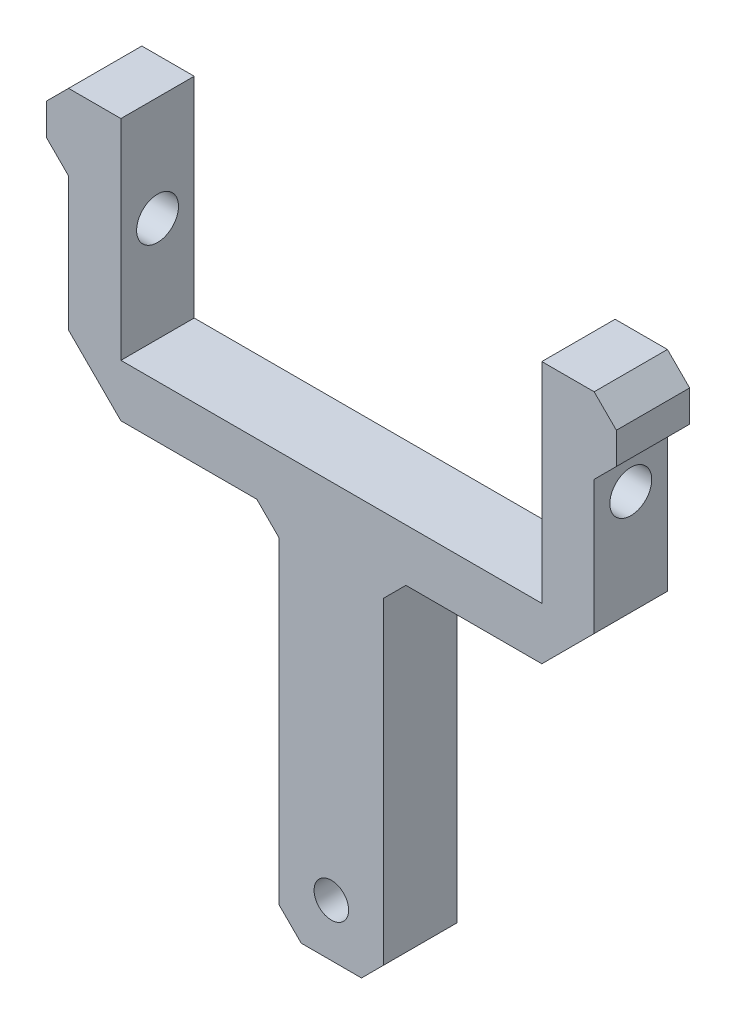
ISO-10303-21;
HEADER;
FILE_DESCRIPTION(('STEP AP214'),'2;1');
FILE_NAME('part.step','',(''),(''),'','','');
FILE_SCHEMA(('AUTOMOTIVE_DESIGN { 1 0 10303 214 1 1 1 1 }'));
ENDSEC;
DATA;
#1=APPLICATION_CONTEXT('core data for automotive mechanical design processes');
#2=APPLICATION_PROTOCOL_DEFINITION('international standard','automotive_design',2000,#1);
#3=PRODUCT_CONTEXT('',#1,'mechanical');
#4=PRODUCT('Part','Part','',(#3));
#5=PRODUCT_RELATED_PRODUCT_CATEGORY('part','',(#4));
#6=PRODUCT_DEFINITION_FORMATION('','',#4);
#7=PRODUCT_DEFINITION_CONTEXT('part definition',#1,'design');
#8=PRODUCT_DEFINITION('design','',#6,#7);
#9=PRODUCT_DEFINITION_SHAPE('','',#8);
#10=(LENGTH_UNIT() NAMED_UNIT(*) SI_UNIT(.MILLI.,.METRE.));
#11=(NAMED_UNIT(*) PLANE_ANGLE_UNIT() SI_UNIT($,.RADIAN.));
#12=(NAMED_UNIT(*) SI_UNIT($,.STERADIAN.) SOLID_ANGLE_UNIT());
#13=UNCERTAINTY_MEASURE_WITH_UNIT(LENGTH_MEASURE(1.E-05),#10,'distance_accuracy_value','');
#14=(GEOMETRIC_REPRESENTATION_CONTEXT(3) GLOBAL_UNCERTAINTY_ASSIGNED_CONTEXT((#13)) GLOBAL_UNIT_ASSIGNED_CONTEXT((#10,
#11,#12)) REPRESENTATION_CONTEXT('',''));
#15=CARTESIAN_POINT('',(0.,0.,0.));
#16=DIRECTION('',(0.,0.,1.));
#17=DIRECTION('',(1.,0.,0.));
#18=AXIS2_PLACEMENT_3D('',#15,#16,#17);
#19=CARTESIAN_POINT('',(-11.1286796564404,11.1286796564404,7.));
#20=DIRECTION('',(0.707106781186546,-0.707106781186549,0.));
#21=DIRECTION('',(0.707106781186549,0.707106781186546,0.));
#22=AXIS2_PLACEMENT_3D('',#19,#20,#21);
#23=PLANE('',#22);
#24=DIRECTION('',(0.,0.,-1.));
#25=VECTOR('',#24,1.);
#26=CARTESIAN_POINT('',(25.1,47.3573593128807,7.));
#27=LINE('',#26,#25);
#28=CARTESIAN_POINT('',(25.1,47.3573593128807,7.));
#29=VERTEX_POINT('',#28);
#30=CARTESIAN_POINT('',(25.1,47.3573593128807,6.03868075976481));
#31=VERTEX_POINT('',#30);
#32=EDGE_CURVE('E224',#29,#31,#27,.T.);
#33=ORIENTED_EDGE('',*,*,#32,.T.);
#34=CARTESIAN_POINT('',(22.34,44.5973593128807,3.5));
#35=DIRECTION('',(0.707106781186546,-0.707106781186549,0.));
#36=DIRECTION('',(-0.707106781186549,-0.707106781186546,0.));
#37=AXIS2_PLACEMENT_3D('',#34,#35,#36);
#38=ELLIPSE('',#37,5.30330085889912,3.75);
#39=CARTESIAN_POINT('',(25.1,47.3573593128807,0.961319240235193));
#40=VERTEX_POINT('',#39);
#41=EDGE_CURVE('E215',#31,#40,#38,.F.);
#42=ORIENTED_EDGE('',*,*,#41,.T.);
#43=CARTESIAN_POINT('',(25.1,47.3573593128807,0.));
#44=VERTEX_POINT('',#43);
#45=EDGE_CURVE('E221',#40,#44,#27,.T.);
#46=ORIENTED_EDGE('',*,*,#45,.T.);
#47=DIRECTION('',(-0.707106781186549,-0.707106781186546,0.));
#48=VECTOR('',#47,1.);
#49=CARTESIAN_POINT('',(-11.1286796564404,11.1286796564404,0.));
#50=LINE('',#49,#48);
#51=CARTESIAN_POINT('',(27.2213203435596,49.4786796564403,0.));
#52=VERTEX_POINT('',#51);
#53=EDGE_CURVE('E279',#52,#44,#50,.T.);
#54=ORIENTED_EDGE('',*,*,#53,.F.);
#55=DIRECTION('',(0.,0.,-1.));
#56=VECTOR('',#55,1.);
#57=CARTESIAN_POINT('',(27.2213203435596,49.4786796564403,7.));
#58=LINE('',#57,#56);
#59=CARTESIAN_POINT('',(27.2213203435596,49.4786796564403,7.));
#60=VERTEX_POINT('',#59);
#61=EDGE_CURVE('E233',#60,#52,#58,.T.);
#62=ORIENTED_EDGE('',*,*,#61,.F.);
#63=DIRECTION('',(-0.707106781186549,-0.707106781186546,0.));
#64=VECTOR('',#63,1.);
#65=CARTESIAN_POINT('',(-11.1286796564404,11.1286796564404,7.));
#66=LINE('',#65,#64);
#67=EDGE_CURVE('E416',#60,#29,#66,.T.);
#68=ORIENTED_EDGE('',*,*,#67,.T.);
#69=EDGE_LOOP('',(#33,#42,#46,#54,#62,#68));
#70=FACE_BOUND('',#69,.T.);
#71=ADVANCED_FACE('F41',(#70),#23,.T.);
#72=CARTESIAN_POINT('',(11.1286796564404,11.1286796564404,7.));
#73=DIRECTION('',(0.707106781186546,0.707106781186549,0.));
#74=DIRECTION('',(-0.707106781186549,0.707106781186546,0.));
#75=AXIS2_PLACEMENT_3D('',#72,#73,#74);
#76=PLANE('',#75);
#77=CARTESIAN_POINT('',(-22.34,44.5973593128807,3.5));
#78=DIRECTION('',(0.707106781186546,0.707106781186549,0.));
#79=DIRECTION('',(0.707106781186549,-0.707106781186546,0.));
#80=AXIS2_PLACEMENT_3D('',#77,#78,#79);
#81=ELLIPSE('',#80,5.30330085889912,3.75);
#82=CARTESIAN_POINT('',(-25.1,47.3573593128807,6.0386807597648));
#83=VERTEX_POINT('',#82);
#84=CARTESIAN_POINT('',(-25.1,47.3573593128807,0.9613192402352));
#85=VERTEX_POINT('',#84);
#86=EDGE_CURVE('E872',#83,#85,#81,.F.);
#87=ORIENTED_EDGE('',*,*,#86,.F.);
#88=DIRECTION('',(0.,0.,-1.));
#89=VECTOR('',#88,1.);
#90=CARTESIAN_POINT('',(-25.1,47.3573593128807,7.));
#91=LINE('',#90,#89);
#92=CARTESIAN_POINT('',(-25.1,47.3573593128807,7.));
#93=VERTEX_POINT('',#92);
#94=EDGE_CURVE('E355',#93,#83,#91,.T.);
#95=ORIENTED_EDGE('',*,*,#94,.F.);
#96=DIRECTION('',(0.707106781186549,-0.707106781186546,0.));
#97=VECTOR('',#96,1.);
#98=CARTESIAN_POINT('',(11.1286796564404,11.1286796564404,7.));
#99=LINE('',#98,#97);
#100=CARTESIAN_POINT('',(-27.2213203435596,49.4786796564403,7.));
#101=VERTEX_POINT('',#100);
#102=EDGE_CURVE('E439',#101,#93,#99,.T.);
#103=ORIENTED_EDGE('',*,*,#102,.F.);
#104=DIRECTION('',(0.,0.,-1.));
#105=VECTOR('',#104,1.);
#106=CARTESIAN_POINT('',(-27.2213203435596,49.4786796564403,7.));
#107=LINE('',#106,#105);
#108=CARTESIAN_POINT('',(-27.2213203435596,49.4786796564403,0.));
#109=VERTEX_POINT('',#108);
#110=EDGE_CURVE('E358',#101,#109,#107,.T.);
#111=ORIENTED_EDGE('',*,*,#110,.T.);
#112=DIRECTION('',(0.707106781186549,-0.707106781186546,0.));
#113=VECTOR('',#112,1.);
#114=CARTESIAN_POINT('',(11.1286796564404,11.1286796564404,0.));
#115=LINE('',#114,#113);
#116=CARTESIAN_POINT('',(-25.1,47.3573593128807,0.));
#117=VERTEX_POINT('',#116);
#118=EDGE_CURVE('E315',#109,#117,#115,.T.);
#119=ORIENTED_EDGE('',*,*,#118,.T.);
#120=EDGE_CURVE('E354',#85,#117,#91,.T.);
#121=ORIENTED_EDGE('',*,*,#120,.F.);
#122=EDGE_LOOP('',(#87,#95,#103,#111,#119,#121));
#123=FACE_BOUND('',#122,.T.);
#124=ADVANCED_FACE('F506',(#123),#76,.F.);
#125=CARTESIAN_POINT('',(-5.,0.,7.));
#126=DIRECTION('',(-1.,0.,0.));
#127=DIRECTION('',(0.,0.,1.));
#128=AXIS2_PLACEMENT_3D('',#125,#126,#127);
#129=PLANE('',#128);
#130=DIRECTION('',(0.,0.,-1.));
#131=VECTOR('',#130,1.);
#132=CARTESIAN_POINT('',(-5.,-2.87867965644036,7.));
#133=LINE('',#132,#131);
#134=CARTESIAN_POINT('',(-5.,-2.87867965644036,7.));
#135=VERTEX_POINT('',#134);
#136=CARTESIAN_POINT('',(-5.,-2.87867965644036,0.));
#137=VERTEX_POINT('',#136);
#138=EDGE_CURVE('E817',#135,#137,#133,.T.);
#139=ORIENTED_EDGE('',*,*,#138,.F.);
#140=DIRECTION('',(0.,1.,0.));
#141=VECTOR('',#140,1.);
#142=CARTESIAN_POINT('',(-5.,0.,7.));
#143=LINE('',#142,#141);
#144=CARTESIAN_POINT('',(-5.,27.4786796564403,7.));
#145=VERTEX_POINT('',#144);
#146=EDGE_CURVE('E338',#135,#145,#143,.T.);
#147=ORIENTED_EDGE('',*,*,#146,.T.);
#148=DIRECTION('',(0.,0.,-1.));
#149=VECTOR('',#148,1.);
#150=CARTESIAN_POINT('',(-5.,27.4786796564403,7.));
#151=LINE('',#150,#149);
#152=CARTESIAN_POINT('',(-5.,27.4786796564403,0.));
#153=VERTEX_POINT('',#152);
#154=EDGE_CURVE('E339',#145,#153,#151,.T.);
#155=ORIENTED_EDGE('',*,*,#154,.T.);
#156=DIRECTION('',(0.,1.,0.));
#157=VECTOR('',#156,1.);
#158=CARTESIAN_POINT('',(-5.,0.,0.));
#159=LINE('',#158,#157);
#160=EDGE_CURVE('E459',#137,#153,#159,.T.);
#161=ORIENTED_EDGE('',*,*,#160,.F.);
#162=EDGE_LOOP('',(#139,#147,#155,#161));
#163=FACE_BOUND('',#162,.T.);
#164=ADVANCED_FACE('F43',(#163),#129,.T.);
#165=CARTESIAN_POINT('',(0.,-5.,7.));
#166=DIRECTION('',(0.,1.,0.));
#167=DIRECTION('',(0.,0.,1.));
#168=AXIS2_PLACEMENT_3D('',#165,#166,#167);
#169=PLANE('',#168);
#170=DIRECTION('',(1.,0.,0.));
#171=VECTOR('',#170,1.);
#172=CARTESIAN_POINT('',(0.,-5.,0.));
#173=LINE('',#172,#171);
#174=CARTESIAN_POINT('',(-2.87867965644035,-4.99999999999999,0.));
#175=VERTEX_POINT('',#174);
#176=CARTESIAN_POINT('',(2.87867965644035,-5.,0.));
#177=VERTEX_POINT('',#176);
#178=EDGE_CURVE('E462',#175,#177,#173,.T.);
#179=ORIENTED_EDGE('',*,*,#178,.T.);
#180=DIRECTION('',(0.,0.,-1.));
#181=VECTOR('',#180,1.);
#182=CARTESIAN_POINT('',(2.87867965644035,-5.,7.));
#183=LINE('',#182,#181);
#184=CARTESIAN_POINT('',(2.87867965644035,-5.,7.));
#185=VERTEX_POINT('',#184);
#186=EDGE_CURVE('E804',#185,#177,#183,.T.);
#187=ORIENTED_EDGE('',*,*,#186,.F.);
#188=DIRECTION('',(1.,0.,0.));
#189=VECTOR('',#188,1.);
#190=CARTESIAN_POINT('',(0.,-5.,7.));
#191=LINE('',#190,#189);
#192=CARTESIAN_POINT('',(-2.87867965644035,-4.99999999999999,7.));
#193=VERTEX_POINT('',#192);
#194=EDGE_CURVE('E482',#193,#185,#191,.T.);
#195=ORIENTED_EDGE('',*,*,#194,.F.);
#196=DIRECTION('',(0.,0.,-1.));
#197=VECTOR('',#196,1.);
#198=CARTESIAN_POINT('',(-2.87867965644035,-4.99999999999999,7.));
#199=LINE('',#198,#197);
#200=EDGE_CURVE('E806',#193,#175,#199,.T.);
#201=ORIENTED_EDGE('',*,*,#200,.T.);
#202=EDGE_LOOP('',(#179,#187,#195,#201));
#203=FACE_BOUND('',#202,.T.);
#204=ADVANCED_FACE('F736',(#203),#169,.F.);
#205=CARTESIAN_POINT('',(5.,0.,7.));
#206=DIRECTION('',(-1.,0.,0.));
#207=DIRECTION('',(0.,0.,1.));
#208=AXIS2_PLACEMENT_3D('',#205,#206,#207);
#209=PLANE('',#208);
#210=DIRECTION('',(0.,1.,0.));
#211=VECTOR('',#210,1.);
#212=CARTESIAN_POINT('',(5.,0.,7.));
#213=LINE('',#212,#211);
#214=CARTESIAN_POINT('',(5.,-2.87867965644037,7.));
#215=VERTEX_POINT('',#214);
#216=CARTESIAN_POINT('',(5.,27.4786796564403,7.));
#217=VERTEX_POINT('',#216);
#218=EDGE_CURVE('E476',#215,#217,#213,.T.);
#219=ORIENTED_EDGE('',*,*,#218,.F.);
#220=DIRECTION('',(0.,0.,-1.));
#221=VECTOR('',#220,1.);
#222=CARTESIAN_POINT('',(5.,-2.87867965644037,7.));
#223=LINE('',#222,#221);
#224=CARTESIAN_POINT('',(5.,-2.87867965644037,0.));
#225=VERTEX_POINT('',#224);
#226=EDGE_CURVE('E463',#215,#225,#223,.T.);
#227=ORIENTED_EDGE('',*,*,#226,.T.);
#228=DIRECTION('',(0.,1.,0.));
#229=VECTOR('',#228,1.);
#230=CARTESIAN_POINT('',(5.,0.,0.));
#231=LINE('',#230,#229);
#232=CARTESIAN_POINT('',(5.,27.4786796564403,0.));
#233=VERTEX_POINT('',#232);
#234=EDGE_CURVE('E273',#225,#233,#231,.T.);
#235=ORIENTED_EDGE('',*,*,#234,.T.);
#236=DIRECTION('',(0.,0.,-1.));
#237=VECTOR('',#236,1.);
#238=CARTESIAN_POINT('',(5.,27.4786796564403,7.));
#239=LINE('',#238,#237);
#240=EDGE_CURVE('E11',#217,#233,#239,.T.);
#241=ORIENTED_EDGE('',*,*,#240,.F.);
#242=EDGE_LOOP('',(#219,#227,#235,#241));
#243=FACE_BOUND('',#242,.T.);
#244=ADVANCED_FACE('F471',(#243),#209,.F.);
#245=CARTESIAN_POINT('',(-11.2393398282202,11.2393398282202,7.));
#246=DIRECTION('',(-0.707106781186547,0.707106781186549,0.));
#247=DIRECTION('',(-0.707106781186549,-0.707106781186546,0.));
#248=AXIS2_PLACEMENT_3D('',#245,#246,#247);
#249=PLANE('',#248);
#250=DIRECTION('',(0.707106781186549,0.707106781186546,0.));
#251=VECTOR('',#250,1.);
#252=CARTESIAN_POINT('',(-11.2393398282202,11.2393398282202,0.));
#253=LINE('',#252,#251);
#254=CARTESIAN_POINT('',(7.12132034355965,29.6,0.));
#255=VERTEX_POINT('',#254);
#256=EDGE_CURVE('E265',#233,#255,#253,.T.);
#257=ORIENTED_EDGE('',*,*,#256,.T.);
#258=DIRECTION('',(0.,0.,-1.));
#259=VECTOR('',#258,1.);
#260=CARTESIAN_POINT('',(7.12132034355965,29.6,7.));
#261=LINE('',#260,#259);
#262=CARTESIAN_POINT('',(7.12132034355965,29.6,7.));
#263=VERTEX_POINT('',#262);
#264=EDGE_CURVE('E50',#263,#255,#261,.T.);
#265=ORIENTED_EDGE('',*,*,#264,.F.);
#266=DIRECTION('',(0.707106781186549,0.707106781186546,0.));
#267=VECTOR('',#266,1.);
#268=CARTESIAN_POINT('',(-11.2393398282202,11.2393398282202,7.));
#269=LINE('',#268,#267);
#270=EDGE_CURVE('E474',#217,#263,#269,.T.);
#271=ORIENTED_EDGE('',*,*,#270,.F.);
#272=ORIENTED_EDGE('',*,*,#240,.T.);
#273=EDGE_LOOP('',(#257,#265,#271,#272));
#274=FACE_BOUND('',#273,.T.);
#275=ADVANCED_FACE('F473',(#274),#249,.F.);
#276=CARTESIAN_POINT('',(0.,29.6,7.));
#277=DIRECTION('',(0.,1.,0.));
#278=DIRECTION('',(-1.,0.,0.));
#279=AXIS2_PLACEMENT_3D('',#276,#277,#278);
#280=PLANE('',#279);
#281=DIRECTION('',(1.,0.,0.));
#282=VECTOR('',#281,1.);
#283=CARTESIAN_POINT('',(0.,29.6,0.));
#284=LINE('',#283,#282);
#285=CARTESIAN_POINT('',(20.1026406871193,29.6,0.));
#286=VERTEX_POINT('',#285);
#287=EDGE_CURVE('E255',#255,#286,#284,.T.);
#288=ORIENTED_EDGE('',*,*,#287,.T.);
#289=DIRECTION('',(0.,0.,-1.));
#290=VECTOR('',#289,1.);
#291=CARTESIAN_POINT('',(20.1026406871193,29.6,7.));
#292=LINE('',#291,#290);
#293=CARTESIAN_POINT('',(20.1026406871193,29.6,7.));
#294=VERTEX_POINT('',#293);
#295=EDGE_CURVE('E244',#294,#286,#292,.T.);
#296=ORIENTED_EDGE('',*,*,#295,.F.);
#297=DIRECTION('',(1.,0.,0.));
#298=VECTOR('',#297,1.);
#299=CARTESIAN_POINT('',(0.,29.6,7.));
#300=LINE('',#299,#298);
#301=EDGE_CURVE('E257',#263,#294,#300,.T.);
#302=ORIENTED_EDGE('',*,*,#301,.F.);
#303=ORIENTED_EDGE('',*,*,#264,.T.);
#304=EDGE_LOOP('',(#288,#296,#302,#303));
#305=FACE_BOUND('',#304,.T.);
#306=ADVANCED_FACE('F253',(#305),#280,.F.);
#307=CARTESIAN_POINT('',(-4.74867965644034,4.74867965644034,7.));
#308=DIRECTION('',(0.707106781186548,-0.707106781186547,0.));
#309=DIRECTION('',(0.707106781186547,0.707106781186548,0.));
#310=AXIS2_PLACEMENT_3D('',#307,#308,#309);
#311=PLANE('',#310);
#312=DIRECTION('',(-0.707106781186547,-0.707106781186548,0.));
#313=VECTOR('',#312,1.);
#314=CARTESIAN_POINT('',(-4.74867965644034,4.74867965644034,0.));
#315=LINE('',#314,#313);
#316=CARTESIAN_POINT('',(25.1,34.5973593128807,0.));
#317=VERTEX_POINT('',#316);
#318=EDGE_CURVE('E267',#317,#286,#315,.T.);
#319=ORIENTED_EDGE('',*,*,#318,.F.);
#320=DIRECTION('',(0.,0.,-1.));
#321=VECTOR('',#320,1.);
#322=CARTESIAN_POINT('',(25.1,34.5973593128807,7.));
#323=LINE('',#322,#321);
#324=CARTESIAN_POINT('',(25.1,34.5973593128807,7.));
#325=VERTEX_POINT('',#324);
#326=EDGE_CURVE('E237',#325,#317,#323,.T.);
#327=ORIENTED_EDGE('',*,*,#326,.F.);
#328=DIRECTION('',(-0.707106781186547,-0.707106781186548,0.));
#329=VECTOR('',#328,1.);
#330=CARTESIAN_POINT('',(-4.74867965644034,4.74867965644034,7.));
#331=LINE('',#330,#329);
#332=EDGE_CURVE('E480',#325,#294,#331,.T.);
#333=ORIENTED_EDGE('',*,*,#332,.T.);
#334=ORIENTED_EDGE('',*,*,#295,.T.);
#335=EDGE_LOOP('',(#319,#327,#333,#334));
#336=FACE_BOUND('',#335,.T.);
#337=ADVANCED_FACE('F496',(#336),#311,.T.);
#338=CARTESIAN_POINT('',(25.1,0.,7.));
#339=DIRECTION('',(1.,0.,0.));
#340=DIRECTION('',(0.,0.,-1.));
#341=AXIS2_PLACEMENT_3D('',#338,#339,#340);
#342=PLANE('',#341);
#343=ORIENTED_EDGE('',*,*,#45,.F.);
#344=CARTESIAN_POINT('',(25.1,44.5973593128807,3.5));
#345=DIRECTION('',(1.,0.,0.));
#346=DIRECTION('',(0.,1.,0.));
#347=AXIS2_PLACEMENT_3D('',#344,#345,#346);
#348=CIRCLE('',#347,3.75);
#349=EDGE_CURVE('E57',#40,#31,#348,.T.);
#350=ORIENTED_EDGE('',*,*,#349,.T.);
#351=ORIENTED_EDGE('',*,*,#32,.F.);
#352=DIRECTION('',(0.,-1.,0.));
#353=VECTOR('',#352,1.);
#354=CARTESIAN_POINT('',(25.1,0.,7.));
#355=LINE('',#354,#353);
#356=EDGE_CURVE('E489',#29,#325,#355,.T.);
#357=ORIENTED_EDGE('',*,*,#356,.T.);
#358=ORIENTED_EDGE('',*,*,#326,.T.);
#359=DIRECTION('',(0.,-1.,0.));
#360=VECTOR('',#359,1.);
#361=CARTESIAN_POINT('',(25.1,0.,0.));
#362=LINE('',#361,#360);
#363=EDGE_CURVE('E230',#44,#317,#362,.T.);
#364=ORIENTED_EDGE('',*,*,#363,.F.);
#365=EDGE_LOOP('',(#343,#350,#351,#357,#358,#364));
#366=FACE_BOUND('',#365,.T.);
#367=CARTESIAN_POINT('',(25.1,44.5973593128807,3.5));
#368=DIRECTION('',(1.,0.,0.));
#369=DIRECTION('',(0.,0.,-1.));
#370=AXIS2_PLACEMENT_3D('',#367,#368,#369);
#371=CIRCLE('',#370,2.);
#372=CARTESIAN_POINT('',(25.1,44.5973593128807,1.5));
#373=VERTEX_POINT('',#372);
#374=EDGE_CURVE('E830',#373,#373,#371,.T.);
#375=ORIENTED_EDGE('',*,*,#374,.F.);
#376=EDGE_LOOP('',(#375));
#377=FACE_BOUND('',#376,.T.);
#378=ADVANCED_FACE('F227',(#366,#377),#342,.T.);
#379=CARTESIAN_POINT('',(27.2213203435596,0.,7.));
#380=DIRECTION('',(1.,0.,0.));
#381=DIRECTION('',(0.,0.,-1.));
#382=AXIS2_PLACEMENT_3D('',#379,#380,#381);
#383=PLANE('',#382);
#384=DIRECTION('',(0.,-1.,0.));
#385=VECTOR('',#384,1.);
#386=CARTESIAN_POINT('',(27.2213203435596,0.,0.));
#387=LINE('',#386,#385);
#388=CARTESIAN_POINT('',(27.2213203435596,52.4786796564403,0.));
#389=VERTEX_POINT('',#388);
#390=EDGE_CURVE('E282',#389,#52,#387,.T.);
#391=ORIENTED_EDGE('',*,*,#390,.F.);
#392=DIRECTION('',(0.,0.,-1.));
#393=VECTOR('',#392,1.);
#394=CARTESIAN_POINT('',(27.2213203435596,52.4786796564403,7.));
#395=LINE('',#394,#393);
#396=CARTESIAN_POINT('',(27.2213203435596,52.4786796564403,7.));
#397=VERTEX_POINT('',#396);
#398=EDGE_CURVE('E238',#397,#389,#395,.T.);
#399=ORIENTED_EDGE('',*,*,#398,.F.);
#400=DIRECTION('',(0.,-1.,0.));
#401=VECTOR('',#400,1.);
#402=CARTESIAN_POINT('',(27.2213203435596,0.,7.));
#403=LINE('',#402,#401);
#404=EDGE_CURVE('E409',#397,#60,#403,.T.);
#405=ORIENTED_EDGE('',*,*,#404,.T.);
#406=ORIENTED_EDGE('',*,*,#61,.T.);
#407=EDGE_LOOP('',(#391,#399,#405,#406));
#408=FACE_BOUND('',#407,.T.);
#409=ADVANCED_FACE('F395',(#408),#383,.T.);
#410=CARTESIAN_POINT('',(39.85,39.85,7.));
#411=DIRECTION('',(0.707106781186547,0.707106781186547,0.));
#412=DIRECTION('',(-0.707106781186548,0.707106781186548,0.));
#413=AXIS2_PLACEMENT_3D('',#410,#411,#412);
#414=PLANE('',#413);
#415=DIRECTION('',(0.707106781186548,-0.707106781186548,0.));
#416=VECTOR('',#415,1.);
#417=CARTESIAN_POINT('',(39.85,39.85,0.));
#418=LINE('',#417,#416);
#419=CARTESIAN_POINT('',(25.1,54.6,0.));
#420=VERTEX_POINT('',#419);
#421=EDGE_CURVE('E286',#420,#389,#418,.T.);
#422=ORIENTED_EDGE('',*,*,#421,.F.);
#423=DIRECTION('',(0.,0.,-1.));
#424=VECTOR('',#423,1.);
#425=CARTESIAN_POINT('',(25.1,54.6,7.));
#426=LINE('',#425,#424);
#427=CARTESIAN_POINT('',(25.1,54.6,7.));
#428=VERTEX_POINT('',#427);
#429=EDGE_CURVE('E382',#428,#420,#426,.T.);
#430=ORIENTED_EDGE('',*,*,#429,.F.);
#431=DIRECTION('',(0.707106781186548,-0.707106781186548,0.));
#432=VECTOR('',#431,1.);
#433=CARTESIAN_POINT('',(39.85,39.85,7.));
#434=LINE('',#433,#432);
#435=EDGE_CURVE('E391',#428,#397,#434,.T.);
#436=ORIENTED_EDGE('',*,*,#435,.T.);
#437=ORIENTED_EDGE('',*,*,#398,.T.);
#438=EDGE_LOOP('',(#422,#430,#436,#437));
#439=FACE_BOUND('',#438,.T.);
#440=ADVANCED_FACE('F389',(#439),#414,.T.);
#441=CARTESIAN_POINT('',(0.,54.6,7.));
#442=DIRECTION('',(0.,1.,0.));
#443=DIRECTION('',(0.,0.,1.));
#444=AXIS2_PLACEMENT_3D('',#441,#442,#443);
#445=PLANE('',#444);
#446=DIRECTION('',(1.,0.,0.));
#447=VECTOR('',#446,1.);
#448=CARTESIAN_POINT('',(0.,54.6,0.));
#449=LINE('',#448,#447);
#450=CARTESIAN_POINT('',(20.1,54.6,0.));
#451=VERTEX_POINT('',#450);
#452=EDGE_CURVE('E290',#451,#420,#449,.T.);
#453=ORIENTED_EDGE('',*,*,#452,.F.);
#454=DIRECTION('',(0.,0.,-1.));
#455=VECTOR('',#454,1.);
#456=CARTESIAN_POINT('',(20.1,54.6,7.));
#457=LINE('',#456,#455);
#458=CARTESIAN_POINT('',(20.1,54.6,7.));
#459=VERTEX_POINT('',#458);
#460=EDGE_CURVE('E379',#459,#451,#457,.T.);
#461=ORIENTED_EDGE('',*,*,#460,.F.);
#462=DIRECTION('',(1.,0.,0.));
#463=VECTOR('',#462,1.);
#464=CARTESIAN_POINT('',(0.,54.6,7.));
#465=LINE('',#464,#463);
#466=EDGE_CURVE('E403',#459,#428,#465,.T.);
#467=ORIENTED_EDGE('',*,*,#466,.T.);
#468=ORIENTED_EDGE('',*,*,#429,.T.);
#469=EDGE_LOOP('',(#453,#461,#467,#468));
#470=FACE_BOUND('',#469,.T.);
#471=ADVANCED_FACE('F399',(#470),#445,.T.);
#472=CARTESIAN_POINT('',(20.1,0.,7.));
#473=DIRECTION('',(1.,0.,0.));
#474=DIRECTION('',(0.,0.,-1.));
#475=AXIS2_PLACEMENT_3D('',#472,#473,#474);
#476=PLANE('',#475);
#477=CARTESIAN_POINT('',(20.1,44.5973593128807,3.5));
#478=DIRECTION('',(1.,0.,0.));
#479=DIRECTION('',(0.,0.,-1.));
#480=AXIS2_PLACEMENT_3D('',#477,#478,#479);
#481=CIRCLE('',#480,2.);
#482=CARTESIAN_POINT('',(20.1,44.5973593128807,1.5));
#483=VERTEX_POINT('',#482);
#484=EDGE_CURVE('E886',#483,#483,#481,.T.);
#485=ORIENTED_EDGE('',*,*,#484,.T.);
#486=EDGE_LOOP('',(#485));
#487=FACE_BOUND('',#486,.T.);
#488=DIRECTION('',(0.,-1.,0.));
#489=VECTOR('',#488,1.);
#490=CARTESIAN_POINT('',(20.1,0.,0.));
#491=LINE('',#490,#489);
#492=CARTESIAN_POINT('',(20.1,34.6,0.));
#493=VERTEX_POINT('',#492);
#494=EDGE_CURVE('E294',#451,#493,#491,.T.);
#495=ORIENTED_EDGE('',*,*,#494,.T.);
#496=DIRECTION('',(0.,0.,-1.));
#497=VECTOR('',#496,1.);
#498=CARTESIAN_POINT('',(20.1,34.6,7.));
#499=LINE('',#498,#497);
#500=CARTESIAN_POINT('',(20.1,34.6,7.));
#501=VERTEX_POINT('',#500);
#502=EDGE_CURVE('E376',#501,#493,#499,.T.);
#503=ORIENTED_EDGE('',*,*,#502,.F.);
#504=DIRECTION('',(0.,-1.,0.));
#505=VECTOR('',#504,1.);
#506=CARTESIAN_POINT('',(20.1,0.,7.));
#507=LINE('',#506,#505);
#508=EDGE_CURVE('E414',#459,#501,#507,.T.);
#509=ORIENTED_EDGE('',*,*,#508,.F.);
#510=ORIENTED_EDGE('',*,*,#460,.T.);
#511=EDGE_LOOP('',(#495,#503,#509,#510));
#512=FACE_BOUND('',#511,.T.);
#513=ADVANCED_FACE('F520',(#487,#512),#476,.F.);
#514=CARTESIAN_POINT('',(0.,34.6,7.));
#515=DIRECTION('',(0.,1.,0.));
#516=DIRECTION('',(0.,0.,1.));
#517=AXIS2_PLACEMENT_3D('',#514,#515,#516);
#518=PLANE('',#517);
#519=DIRECTION('',(1.,0.,0.));
#520=VECTOR('',#519,1.);
#521=CARTESIAN_POINT('',(0.,34.6,0.));
#522=LINE('',#521,#520);
#523=CARTESIAN_POINT('',(-20.1,34.6,0.));
#524=VERTEX_POINT('',#523);
#525=EDGE_CURVE('E298',#524,#493,#522,.T.);
#526=ORIENTED_EDGE('',*,*,#525,.F.);
#527=DIRECTION('',(0.,0.,-1.));
#528=VECTOR('',#527,1.);
#529=CARTESIAN_POINT('',(-20.1,34.6,7.));
#530=LINE('',#529,#528);
#531=CARTESIAN_POINT('',(-20.1,34.6,7.));
#532=VERTEX_POINT('',#531);
#533=EDGE_CURVE('E373',#532,#524,#530,.T.);
#534=ORIENTED_EDGE('',*,*,#533,.F.);
#535=DIRECTION('',(1.,0.,0.));
#536=VECTOR('',#535,1.);
#537=CARTESIAN_POINT('',(0.,34.6,7.));
#538=LINE('',#537,#536);
#539=EDGE_CURVE('E422',#532,#501,#538,.T.);
#540=ORIENTED_EDGE('',*,*,#539,.T.);
#541=ORIENTED_EDGE('',*,*,#502,.T.);
#542=EDGE_LOOP('',(#526,#534,#540,#541));
#543=FACE_BOUND('',#542,.T.);
#544=ADVANCED_FACE('F523',(#543),#518,.T.);
#545=CARTESIAN_POINT('',(-20.1,0.,7.));
#546=DIRECTION('',(1.,0.,0.));
#547=DIRECTION('',(0.,0.,-1.));
#548=AXIS2_PLACEMENT_3D('',#545,#546,#547);
#549=PLANE('',#548);
#550=CARTESIAN_POINT('',(-20.1,44.5973593128807,3.5));
#551=DIRECTION('',(1.,0.,0.));
#552=DIRECTION('',(0.,0.,-1.));
#553=AXIS2_PLACEMENT_3D('',#550,#551,#552);
#554=CIRCLE('',#553,2.);
#555=CARTESIAN_POINT('',(-20.1,44.5973593128807,1.5));
#556=VERTEX_POINT('',#555);
#557=EDGE_CURVE('E879',#556,#556,#554,.T.);
#558=ORIENTED_EDGE('',*,*,#557,.F.);
#559=EDGE_LOOP('',(#558));
#560=FACE_BOUND('',#559,.T.);
#561=DIRECTION('',(0.,-1.,0.));
#562=VECTOR('',#561,1.);
#563=CARTESIAN_POINT('',(-20.1,0.,0.));
#564=LINE('',#563,#562);
#565=CARTESIAN_POINT('',(-20.1,54.6,0.));
#566=VERTEX_POINT('',#565);
#567=EDGE_CURVE('E302',#566,#524,#564,.T.);
#568=ORIENTED_EDGE('',*,*,#567,.F.);
#569=DIRECTION('',(0.,0.,-1.));
#570=VECTOR('',#569,1.);
#571=CARTESIAN_POINT('',(-20.1,54.6,7.));
#572=LINE('',#571,#570);
#573=CARTESIAN_POINT('',(-20.1,54.6,7.));
#574=VERTEX_POINT('',#573);
#575=EDGE_CURVE('E370',#574,#566,#572,.T.);
#576=ORIENTED_EDGE('',*,*,#575,.F.);
#577=DIRECTION('',(0.,-1.,0.));
#578=VECTOR('',#577,1.);
#579=CARTESIAN_POINT('',(-20.1,0.,7.));
#580=LINE('',#579,#578);
#581=EDGE_CURVE('E426',#574,#532,#580,.T.);
#582=ORIENTED_EDGE('',*,*,#581,.T.);
#583=ORIENTED_EDGE('',*,*,#533,.T.);
#584=EDGE_LOOP('',(#568,#576,#582,#583));
#585=FACE_BOUND('',#584,.T.);
#586=ADVANCED_FACE('F527',(#560,#585),#549,.T.);
#587=CARTESIAN_POINT('',(0.,54.6,7.));
#588=DIRECTION('',(0.,-1.,0.));
#589=DIRECTION('',(0.,0.,-1.));
#590=AXIS2_PLACEMENT_3D('',#587,#588,#589);
#591=PLANE('',#590);
#592=DIRECTION('',(-1.,0.,0.));
#593=VECTOR('',#592,1.);
#594=CARTESIAN_POINT('',(0.,54.6,0.));
#595=LINE('',#594,#593);
#596=CARTESIAN_POINT('',(-25.1,54.6,0.));
#597=VERTEX_POINT('',#596);
#598=EDGE_CURVE('E306',#566,#597,#595,.T.);
#599=ORIENTED_EDGE('',*,*,#598,.T.);
#600=DIRECTION('',(0.,0.,-1.));
#601=VECTOR('',#600,1.);
#602=CARTESIAN_POINT('',(-25.1,54.6,7.));
#603=LINE('',#602,#601);
#604=CARTESIAN_POINT('',(-25.1,54.6,7.));
#605=VERTEX_POINT('',#604);
#606=EDGE_CURVE('E366',#605,#597,#603,.T.);
#607=ORIENTED_EDGE('',*,*,#606,.F.);
#608=DIRECTION('',(-1.,0.,0.));
#609=VECTOR('',#608,1.);
#610=CARTESIAN_POINT('',(0.,54.6,7.));
#611=LINE('',#610,#609);
#612=EDGE_CURVE('E430',#574,#605,#611,.T.);
#613=ORIENTED_EDGE('',*,*,#612,.F.);
#614=ORIENTED_EDGE('',*,*,#575,.T.);
#615=EDGE_LOOP('',(#599,#607,#613,#614));
#616=FACE_BOUND('',#615,.T.);
#617=ADVANCED_FACE('F531',(#616),#591,.F.);
#618=CARTESIAN_POINT('',(-39.85,39.85,7.));
#619=DIRECTION('',(0.707106781186547,-0.707106781186547,0.));
#620=DIRECTION('',(0.707106781186548,0.707106781186548,0.));
#621=AXIS2_PLACEMENT_3D('',#618,#619,#620);
#622=PLANE('',#621);
#623=DIRECTION('',(-0.707106781186548,-0.707106781186548,0.));
#624=VECTOR('',#623,1.);
#625=CARTESIAN_POINT('',(-39.85,39.85,0.));
#626=LINE('',#625,#624);
#627=CARTESIAN_POINT('',(-27.2213203435596,52.4786796564403,0.));
#628=VERTEX_POINT('',#627);
#629=EDGE_CURVE('E309',#597,#628,#626,.T.);
#630=ORIENTED_EDGE('',*,*,#629,.T.);
#631=DIRECTION('',(0.,0.,-1.));
#632=VECTOR('',#631,1.);
#633=CARTESIAN_POINT('',(-27.2213203435596,52.4786796564403,7.));
#634=LINE('',#633,#632);
#635=CARTESIAN_POINT('',(-27.2213203435596,52.4786796564403,7.));
#636=VERTEX_POINT('',#635);
#637=EDGE_CURVE('E362',#636,#628,#634,.T.);
#638=ORIENTED_EDGE('',*,*,#637,.F.);
#639=DIRECTION('',(-0.707106781186548,-0.707106781186548,0.));
#640=VECTOR('',#639,1.);
#641=CARTESIAN_POINT('',(-39.85,39.85,7.));
#642=LINE('',#641,#640);
#643=EDGE_CURVE('E433',#605,#636,#642,.T.);
#644=ORIENTED_EDGE('',*,*,#643,.F.);
#645=ORIENTED_EDGE('',*,*,#606,.T.);
#646=EDGE_LOOP('',(#630,#638,#644,#645));
#647=FACE_BOUND('',#646,.T.);
#648=ADVANCED_FACE('F535',(#647),#622,.F.);
#649=CARTESIAN_POINT('',(-27.2213203435596,0.,7.));
#650=DIRECTION('',(1.,0.,0.));
#651=DIRECTION('',(0.,0.,-1.));
#652=AXIS2_PLACEMENT_3D('',#649,#650,#651);
#653=PLANE('',#652);
#654=DIRECTION('',(0.,-1.,0.));
#655=VECTOR('',#654,1.);
#656=CARTESIAN_POINT('',(-27.2213203435596,0.,0.));
#657=LINE('',#656,#655);
#658=EDGE_CURVE('E312',#628,#109,#657,.T.);
#659=ORIENTED_EDGE('',*,*,#658,.T.);
#660=ORIENTED_EDGE('',*,*,#110,.F.);
#661=DIRECTION('',(0.,-1.,0.));
#662=VECTOR('',#661,1.);
#663=CARTESIAN_POINT('',(-27.2213203435596,0.,7.));
#664=LINE('',#663,#662);
#665=EDGE_CURVE('E436',#636,#101,#664,.T.);
#666=ORIENTED_EDGE('',*,*,#665,.F.);
#667=ORIENTED_EDGE('',*,*,#637,.T.);
#668=EDGE_LOOP('',(#659,#660,#666,#667));
#669=FACE_BOUND('',#668,.T.);
#670=ADVANCED_FACE('F539',(#669),#653,.F.);
#671=CARTESIAN_POINT('',(-25.1,0.,7.));
#672=DIRECTION('',(1.,0.,0.));
#673=DIRECTION('',(0.,0.,-1.));
#674=AXIS2_PLACEMENT_3D('',#671,#672,#673);
#675=PLANE('',#674);
#676=DIRECTION('',(0.,-1.,0.));
#677=VECTOR('',#676,1.);
#678=CARTESIAN_POINT('',(-25.1,0.,0.));
#679=LINE('',#678,#677);
#680=CARTESIAN_POINT('',(-25.1,34.5973593128807,0.));
#681=VERTEX_POINT('',#680);
#682=EDGE_CURVE('E319',#117,#681,#679,.T.);
#683=ORIENTED_EDGE('',*,*,#682,.T.);
#684=DIRECTION('',(0.,0.,-1.));
#685=VECTOR('',#684,1.);
#686=CARTESIAN_POINT('',(-25.1,34.5973593128807,7.));
#687=LINE('',#686,#685);
#688=CARTESIAN_POINT('',(-25.1,34.5973593128807,7.));
#689=VERTEX_POINT('',#688);
#690=EDGE_CURVE('E350',#689,#681,#687,.T.);
#691=ORIENTED_EDGE('',*,*,#690,.F.);
#692=DIRECTION('',(0.,-1.,0.));
#693=VECTOR('',#692,1.);
#694=CARTESIAN_POINT('',(-25.1,0.,7.));
#695=LINE('',#694,#693);
#696=EDGE_CURVE('E442',#93,#689,#695,.T.);
#697=ORIENTED_EDGE('',*,*,#696,.F.);
#698=ORIENTED_EDGE('',*,*,#94,.T.);
#699=CARTESIAN_POINT('',(-25.1,44.5973593128807,3.5));
#700=DIRECTION('',(-1.,0.,0.));
#701=DIRECTION('',(0.,-1.,0.));
#702=AXIS2_PLACEMENT_3D('',#699,#700,#701);
#703=CIRCLE('',#702,3.75);
#704=EDGE_CURVE('E65',#83,#85,#703,.T.);
#705=ORIENTED_EDGE('',*,*,#704,.T.);
#706=ORIENTED_EDGE('',*,*,#120,.T.);
#707=EDGE_LOOP('',(#683,#691,#697,#698,#705,#706));
#708=FACE_BOUND('',#707,.T.);
#709=CARTESIAN_POINT('',(-25.1,44.5973593128807,3.5));
#710=DIRECTION('',(-1.,0.,0.));
#711=DIRECTION('',(0.,-1.,0.));
#712=AXIS2_PLACEMENT_3D('',#709,#710,#711);
#713=CIRCLE('',#712,2.);
#714=CARTESIAN_POINT('',(-25.1,42.5973593128807,3.5));
#715=VERTEX_POINT('',#714);
#716=EDGE_CURVE('E874',#715,#715,#713,.T.);
#717=ORIENTED_EDGE('',*,*,#716,.F.);
#718=EDGE_LOOP('',(#717));
#719=FACE_BOUND('',#718,.T.);
#720=ADVANCED_FACE('F542',(#708,#719),#675,.F.);
#721=CARTESIAN_POINT('',(4.74867965644034,4.74867965644034,7.));
#722=DIRECTION('',(0.707106781186548,0.707106781186547,0.));
#723=DIRECTION('',(-0.707106781186547,0.707106781186548,0.));
#724=AXIS2_PLACEMENT_3D('',#721,#722,#723);
#725=PLANE('',#724);
#726=DIRECTION('',(0.707106781186547,-0.707106781186548,0.));
#727=VECTOR('',#726,1.);
#728=CARTESIAN_POINT('',(4.74867965644034,4.74867965644034,0.));
#729=LINE('',#728,#727);
#730=CARTESIAN_POINT('',(-20.1026406871193,29.6,0.));
#731=VERTEX_POINT('',#730);
#732=EDGE_CURVE('E322',#681,#731,#729,.T.);
#733=ORIENTED_EDGE('',*,*,#732,.T.);
#734=DIRECTION('',(0.,0.,-1.));
#735=VECTOR('',#734,1.);
#736=CARTESIAN_POINT('',(-20.1026406871193,29.6,7.));
#737=LINE('',#736,#735);
#738=CARTESIAN_POINT('',(-20.1026406871193,29.6,7.));
#739=VERTEX_POINT('',#738);
#740=EDGE_CURVE('E347',#739,#731,#737,.T.);
#741=ORIENTED_EDGE('',*,*,#740,.F.);
#742=DIRECTION('',(0.707106781186547,-0.707106781186548,0.));
#743=VECTOR('',#742,1.);
#744=CARTESIAN_POINT('',(4.74867965644034,4.74867965644034,7.));
#745=LINE('',#744,#743);
#746=EDGE_CURVE('E445',#689,#739,#745,.T.);
#747=ORIENTED_EDGE('',*,*,#746,.F.);
#748=ORIENTED_EDGE('',*,*,#690,.T.);
#749=EDGE_LOOP('',(#733,#741,#747,#748));
#750=FACE_BOUND('',#749,.T.);
#751=ADVANCED_FACE('F547',(#750),#725,.F.);
#752=CARTESIAN_POINT('',(0.,29.6,7.));
#753=DIRECTION('',(0.,-1.,0.));
#754=DIRECTION('',(1.,0.,0.));
#755=AXIS2_PLACEMENT_3D('',#752,#753,#754);
#756=PLANE('',#755);
#757=DIRECTION('',(-1.,0.,0.));
#758=VECTOR('',#757,1.);
#759=CARTESIAN_POINT('',(0.,29.6,0.));
#760=LINE('',#759,#758);
#761=CARTESIAN_POINT('',(-7.12132034355964,29.6,0.));
#762=VERTEX_POINT('',#761);
#763=EDGE_CURVE('E326',#762,#731,#760,.T.);
#764=ORIENTED_EDGE('',*,*,#763,.F.);
#765=DIRECTION('',(0.,0.,-1.));
#766=VECTOR('',#765,1.);
#767=CARTESIAN_POINT('',(-7.12132034355964,29.6,7.));
#768=LINE('',#767,#766);
#769=CARTESIAN_POINT('',(-7.12132034355964,29.6,7.));
#770=VERTEX_POINT('',#769);
#771=EDGE_CURVE('E343',#770,#762,#768,.T.);
#772=ORIENTED_EDGE('',*,*,#771,.F.);
#773=DIRECTION('',(-1.,0.,0.));
#774=VECTOR('',#773,1.);
#775=CARTESIAN_POINT('',(0.,29.6,7.));
#776=LINE('',#775,#774);
#777=EDGE_CURVE('E448',#770,#739,#776,.T.);
#778=ORIENTED_EDGE('',*,*,#777,.T.);
#779=ORIENTED_EDGE('',*,*,#740,.T.);
#780=EDGE_LOOP('',(#764,#772,#778,#779));
#781=FACE_BOUND('',#780,.T.);
#782=ADVANCED_FACE('F550',(#781),#756,.T.);
#783=CARTESIAN_POINT('',(11.2393398282202,11.2393398282201,7.));
#784=DIRECTION('',(-0.707106781186548,-0.707106781186547,0.));
#785=DIRECTION('',(0.707106781186547,-0.707106781186548,0.));
#786=AXIS2_PLACEMENT_3D('',#783,#784,#785);
#787=PLANE('',#786);
#788=DIRECTION('',(-0.707106781186547,0.707106781186548,0.));
#789=VECTOR('',#788,1.);
#790=CARTESIAN_POINT('',(11.2393398282202,11.2393398282201,0.));
#791=LINE('',#790,#789);
#792=EDGE_CURVE('E330',#153,#762,#791,.T.);
#793=ORIENTED_EDGE('',*,*,#792,.F.);
#794=ORIENTED_EDGE('',*,*,#154,.F.);
#795=DIRECTION('',(-0.707106781186547,0.707106781186548,0.));
#796=VECTOR('',#795,1.);
#797=CARTESIAN_POINT('',(11.2393398282202,11.2393398282201,7.));
#798=LINE('',#797,#796);
#799=EDGE_CURVE('E452',#145,#770,#798,.T.);
#800=ORIENTED_EDGE('',*,*,#799,.T.);
#801=ORIENTED_EDGE('',*,*,#771,.T.);
#802=EDGE_LOOP('',(#793,#794,#800,#801));
#803=FACE_BOUND('',#802,.T.);
#804=ADVANCED_FACE('F554',(#803),#787,.T.);
#805=CARTESIAN_POINT('',(0.,0.,7.));
#806=DIRECTION('',(0.,0.,-1.));
#807=DIRECTION('',(-1.,0.,0.));
#808=AXIS2_PLACEMENT_3D('',#805,#806,#807);
#809=CYLINDRICAL_SURFACE('',#808,1.65);
#810=CARTESIAN_POINT('',(0.,0.,7.));
#811=DIRECTION('',(0.,0.,1.));
#812=DIRECTION('',(1.,0.,0.));
#813=AXIS2_PLACEMENT_3D('',#810,#811,#812);
#814=CIRCLE('',#813,1.65);
#815=CARTESIAN_POINT('',(1.65,0.,7.));
#816=VERTEX_POINT('',#815);
#817=EDGE_CURVE('E344',#816,#816,#814,.T.);
#818=ORIENTED_EDGE('',*,*,#817,.T.);
#819=EDGE_LOOP('',(#818));
#820=FACE_BOUND('',#819,.T.);
#821=CARTESIAN_POINT('',(0.,0.,0.));
#822=DIRECTION('',(0.,0.,1.));
#823=DIRECTION('',(1.,0.,0.));
#824=AXIS2_PLACEMENT_3D('',#821,#822,#823);
#825=CIRCLE('',#824,1.65);
#826=CARTESIAN_POINT('',(1.65,0.,0.));
#827=VERTEX_POINT('',#826);
#828=EDGE_CURVE('E334',#827,#827,#825,.T.);
#829=ORIENTED_EDGE('',*,*,#828,.F.);
#830=EDGE_LOOP('',(#829));
#831=FACE_BOUND('',#830,.T.);
#832=ADVANCED_FACE('F558',(#820,#831),#809,.F.);
#833=CARTESIAN_POINT('',(0.,0.,7.));
#834=DIRECTION('',(0.,0.,1.));
#835=DIRECTION('',(1.,0.,0.));
#836=AXIS2_PLACEMENT_3D('',#833,#834,#835);
#837=PLANE('',#836);
#838=DIRECTION('',(0.707106781186551,0.707106781186544,0.));
#839=VECTOR('',#838,1.);
#840=CARTESIAN_POINT('',(2.87867965644035,-5.,7.));
#841=LINE('',#840,#839);
#842=EDGE_CURVE('E812',#185,#215,#841,.T.);
#843=ORIENTED_EDGE('',*,*,#842,.T.);
#844=ORIENTED_EDGE('',*,*,#218,.T.);
#845=ORIENTED_EDGE('',*,*,#270,.T.);
#846=ORIENTED_EDGE('',*,*,#301,.T.);
#847=ORIENTED_EDGE('',*,*,#332,.F.);
#848=ORIENTED_EDGE('',*,*,#356,.F.);
#849=ORIENTED_EDGE('',*,*,#67,.F.);
#850=ORIENTED_EDGE('',*,*,#404,.F.);
#851=ORIENTED_EDGE('',*,*,#435,.F.);
#852=ORIENTED_EDGE('',*,*,#466,.F.);
#853=ORIENTED_EDGE('',*,*,#508,.T.);
#854=ORIENTED_EDGE('',*,*,#539,.F.);
#855=ORIENTED_EDGE('',*,*,#581,.F.);
#856=ORIENTED_EDGE('',*,*,#612,.T.);
#857=ORIENTED_EDGE('',*,*,#643,.T.);
#858=ORIENTED_EDGE('',*,*,#665,.T.);
#859=ORIENTED_EDGE('',*,*,#102,.T.);
#860=ORIENTED_EDGE('',*,*,#696,.T.);
#861=ORIENTED_EDGE('',*,*,#746,.T.);
#862=ORIENTED_EDGE('',*,*,#777,.F.);
#863=ORIENTED_EDGE('',*,*,#799,.F.);
#864=ORIENTED_EDGE('',*,*,#146,.F.);
#865=DIRECTION('',(0.707106781186552,-0.707106781186543,0.));
#866=VECTOR('',#865,1.);
#867=CARTESIAN_POINT('',(-2.87867965644035,-4.99999999999999,7.));
#868=LINE('',#867,#866);
#869=EDGE_CURVE('E825',#135,#193,#868,.T.);
#870=ORIENTED_EDGE('',*,*,#869,.T.);
#871=ORIENTED_EDGE('',*,*,#194,.T.);
#872=EDGE_LOOP('',(#843,#844,#845,#846,#847,#848,#849,#850,#851,#852,#853,#854,#855,#856,#857,
#858,#859,#860,#861,#862,#863,#864,#870,#871));
#873=FACE_BOUND('',#872,.T.);
#874=ORIENTED_EDGE('',*,*,#817,.F.);
#875=EDGE_LOOP('',(#874));
#876=FACE_BOUND('',#875,.T.);
#877=ADVANCED_FACE('F406',(#873,#876),#837,.T.);
#878=CARTESIAN_POINT('',(0.,0.,0.));
#879=DIRECTION('',(0.,0.,1.));
#880=DIRECTION('',(1.,0.,0.));
#881=AXIS2_PLACEMENT_3D('',#878,#879,#880);
#882=PLANE('',#881);
#883=ORIENTED_EDGE('',*,*,#234,.F.);
#884=DIRECTION('',(0.707106781186551,0.707106781186544,0.));
#885=VECTOR('',#884,1.);
#886=CARTESIAN_POINT('',(2.87867965644035,-5.,0.));
#887=LINE('',#886,#885);
#888=EDGE_CURVE('E810',#177,#225,#887,.T.);
#889=ORIENTED_EDGE('',*,*,#888,.F.);
#890=ORIENTED_EDGE('',*,*,#178,.F.);
#891=DIRECTION('',(0.707106781186552,-0.707106781186543,0.));
#892=VECTOR('',#891,1.);
#893=CARTESIAN_POINT('',(-2.87867965644035,-4.99999999999999,0.));
#894=LINE('',#893,#892);
#895=EDGE_CURVE('E808',#137,#175,#894,.T.);
#896=ORIENTED_EDGE('',*,*,#895,.F.);
#897=ORIENTED_EDGE('',*,*,#160,.T.);
#898=ORIENTED_EDGE('',*,*,#792,.T.);
#899=ORIENTED_EDGE('',*,*,#763,.T.);
#900=ORIENTED_EDGE('',*,*,#732,.F.);
#901=ORIENTED_EDGE('',*,*,#682,.F.);
#902=ORIENTED_EDGE('',*,*,#118,.F.);
#903=ORIENTED_EDGE('',*,*,#658,.F.);
#904=ORIENTED_EDGE('',*,*,#629,.F.);
#905=ORIENTED_EDGE('',*,*,#598,.F.);
#906=ORIENTED_EDGE('',*,*,#567,.T.);
#907=ORIENTED_EDGE('',*,*,#525,.T.);
#908=ORIENTED_EDGE('',*,*,#494,.F.);
#909=ORIENTED_EDGE('',*,*,#452,.T.);
#910=ORIENTED_EDGE('',*,*,#421,.T.);
#911=ORIENTED_EDGE('',*,*,#390,.T.);
#912=ORIENTED_EDGE('',*,*,#53,.T.);
#913=ORIENTED_EDGE('',*,*,#363,.T.);
#914=ORIENTED_EDGE('',*,*,#318,.T.);
#915=ORIENTED_EDGE('',*,*,#287,.F.);
#916=ORIENTED_EDGE('',*,*,#256,.F.);
#917=EDGE_LOOP('',(#883,#889,#890,#896,#897,#898,#899,#900,#901,#902,#903,#904,#905,#906,#907,
#908,#909,#910,#911,#912,#913,#914,#915,#916));
#918=FACE_BOUND('',#917,.T.);
#919=ORIENTED_EDGE('',*,*,#828,.T.);
#920=EDGE_LOOP('',(#919));
#921=FACE_BOUND('',#920,.T.);
#922=ADVANCED_FACE('F263',(#918,#921),#882,.F.);
#923=CARTESIAN_POINT('',(-2.87867965644035,-4.99999999999999,7.));
#924=DIRECTION('',(0.707106781186543,0.707106781186552,0.));
#925=DIRECTION('',(-0.707106781186552,0.707106781186543,0.));
#926=AXIS2_PLACEMENT_3D('',#923,#924,#925);
#927=PLANE('',#926);
#928=ORIENTED_EDGE('',*,*,#895,.T.);
#929=ORIENTED_EDGE('',*,*,#200,.F.);
#930=ORIENTED_EDGE('',*,*,#869,.F.);
#931=ORIENTED_EDGE('',*,*,#138,.T.);
#932=EDGE_LOOP('',(#928,#929,#930,#931));
#933=FACE_BOUND('',#932,.T.);
#934=ADVANCED_FACE('F565',(#933),#927,.F.);
#935=CARTESIAN_POINT('',(2.87867965644035,-5.,7.));
#936=DIRECTION('',(-0.707106781186544,0.707106781186551,0.));
#937=DIRECTION('',(-0.707106781186551,-0.707106781186544,0.));
#938=AXIS2_PLACEMENT_3D('',#935,#936,#937);
#939=PLANE('',#938);
#940=ORIENTED_EDGE('',*,*,#888,.T.);
#941=ORIENTED_EDGE('',*,*,#226,.F.);
#942=ORIENTED_EDGE('',*,*,#842,.F.);
#943=ORIENTED_EDGE('',*,*,#186,.T.);
#944=EDGE_LOOP('',(#940,#941,#942,#943));
#945=FACE_BOUND('',#944,.T.);
#946=ADVANCED_FACE('F570',(#945),#939,.F.);
#947=CARTESIAN_POINT('',(27.2213203435597,44.5973593128807,3.5));
#948=DIRECTION('',(-1.,0.,0.));
#949=DIRECTION('',(0.,-1.,0.));
#950=AXIS2_PLACEMENT_3D('',#947,#948,#949);
#951=CYLINDRICAL_SURFACE('',#950,2.);
#952=ORIENTED_EDGE('',*,*,#557,.T.);
#953=EDGE_LOOP('',(#952));
#954=FACE_BOUND('',#953,.T.);
#955=ORIENTED_EDGE('',*,*,#716,.T.);
#956=EDGE_LOOP('',(#955));
#957=FACE_BOUND('',#956,.T.);
#958=ADVANCED_FACE('F574',(#954,#957),#951,.F.);
#959=ORIENTED_EDGE('',*,*,#374,.T.);
#960=EDGE_LOOP('',(#959));
#961=FACE_BOUND('',#960,.T.);
#962=ORIENTED_EDGE('',*,*,#484,.F.);
#963=EDGE_LOOP('',(#962));
#964=FACE_BOUND('',#963,.T.);
#965=ADVANCED_FACE('F578',(#961,#964),#951,.F.);
#966=CARTESIAN_POINT('',(-27.2213203435596,44.5973593128807,3.5));
#967=DIRECTION('',(1.,0.,0.));
#968=DIRECTION('',(0.,1.,0.));
#969=AXIS2_PLACEMENT_3D('',#966,#967,#968);
#970=CYLINDRICAL_SURFACE('',#969,3.75);
#971=ORIENTED_EDGE('',*,*,#86,.T.);
#972=ORIENTED_EDGE('',*,*,#704,.F.);
#973=EDGE_LOOP('',(#971,#972));
#974=FACE_BOUND('',#973,.T.);
#975=ADVANCED_FACE('F580',(#974),#970,.F.);
#976=CARTESIAN_POINT('',(27.2213203435596,44.5973593128807,3.5));
#977=DIRECTION('',(-1.,0.,0.));
#978=DIRECTION('',(0.,-1.,0.));
#979=AXIS2_PLACEMENT_3D('',#976,#977,#978);
#980=CYLINDRICAL_SURFACE('',#979,3.75);
#981=ORIENTED_EDGE('',*,*,#349,.F.);
#982=ORIENTED_EDGE('',*,*,#41,.F.);
#983=EDGE_LOOP('',(#981,#982));
#984=FACE_BOUND('',#983,.T.);
#985=ADVANCED_FACE('F214',(#984),#980,.F.);
#986=CLOSED_SHELL('',(#71,#124,#164,#204,#244,#275,#306,#337,#378,#409,#440,#471,#513,#544,#586,
#617,#648,#670,#720,#751,#782,#804,#832,#877,#922,#934,#946,#958,#965,#975,#985));
#987=MANIFOLD_SOLID_BREP('B2',#986);
#988=ADVANCED_BREP_SHAPE_REPRESENTATION('',(#18,#987),#14);
#989=SHAPE_DEFINITION_REPRESENTATION(#9,#988);
ENDSEC;
END-ISO-10303-21;
